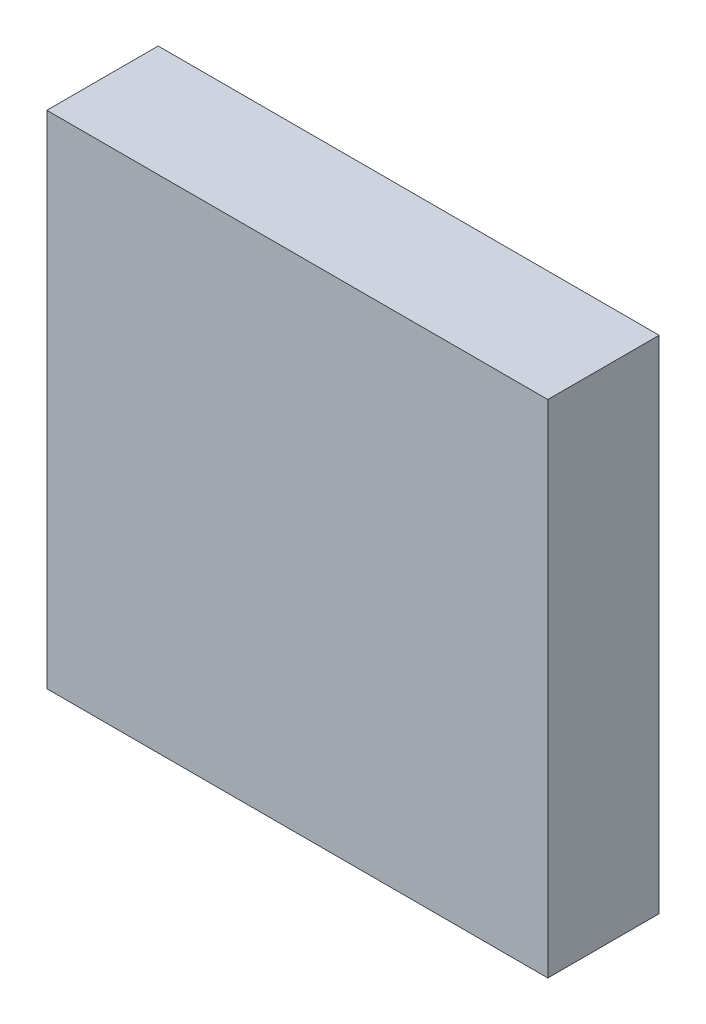
ISO-10303-21;
HEADER;
FILE_DESCRIPTION(('STEP AP214'),'2;1');
FILE_NAME('part.step','',(''),(''),'','','');
FILE_SCHEMA(('AUTOMOTIVE_DESIGN { 1 0 10303 214 1 1 1 1 }'));
ENDSEC;
DATA;
#1=APPLICATION_CONTEXT('core data for automotive mechanical design processes');
#2=APPLICATION_PROTOCOL_DEFINITION('international standard','automotive_design',2000,#1);
#3=PRODUCT_CONTEXT('',#1,'mechanical');
#4=PRODUCT('Part','Part','',(#3));
#5=PRODUCT_RELATED_PRODUCT_CATEGORY('part','',(#4));
#6=PRODUCT_DEFINITION_FORMATION('','',#4);
#7=PRODUCT_DEFINITION_CONTEXT('part definition',#1,'design');
#8=PRODUCT_DEFINITION('design','',#6,#7);
#9=PRODUCT_DEFINITION_SHAPE('','',#8);
#10=(LENGTH_UNIT() NAMED_UNIT(*) SI_UNIT(.MILLI.,.METRE.));
#11=(NAMED_UNIT(*) PLANE_ANGLE_UNIT() SI_UNIT($,.RADIAN.));
#12=(NAMED_UNIT(*) SI_UNIT($,.STERADIAN.) SOLID_ANGLE_UNIT());
#13=UNCERTAINTY_MEASURE_WITH_UNIT(LENGTH_MEASURE(1.E-05),#10,'distance_accuracy_value','');
#14=(GEOMETRIC_REPRESENTATION_CONTEXT(3) GLOBAL_UNCERTAINTY_ASSIGNED_CONTEXT((#13)) GLOBAL_UNIT_ASSIGNED_CONTEXT((#10,
#11,#12)) REPRESENTATION_CONTEXT('',''));
#15=CARTESIAN_POINT('',(0.,0.,0.));
#16=DIRECTION('',(0.,0.,1.));
#17=DIRECTION('',(1.,0.,0.));
#18=AXIS2_PLACEMENT_3D('',#15,#16,#17);
#19=CARTESIAN_POINT('',(-225.,-225.,100.));
#20=DIRECTION('',(1.,0.,0.));
#21=DIRECTION('',(0.,0.,-1.));
#22=AXIS2_PLACEMENT_3D('',#19,#20,#21);
#23=PLANE('',#22);
#24=DIRECTION('',(0.,-1.,0.));
#25=VECTOR('',#24,1.);
#26=CARTESIAN_POINT('',(-225.,-225.,0.));
#27=LINE('',#26,#25);
#28=CARTESIAN_POINT('',(-225.,225.,0.));
#29=VERTEX_POINT('',#28);
#30=CARTESIAN_POINT('',(-225.,-225.,0.));
#31=VERTEX_POINT('',#30);
#32=EDGE_CURVE('E99',#29,#31,#27,.T.);
#33=ORIENTED_EDGE('',*,*,#32,.T.);
#34=DIRECTION('',(0.,0.,-1.));
#35=VECTOR('',#34,1.);
#36=CARTESIAN_POINT('',(-225.,-225.,100.));
#37=LINE('',#36,#35);
#38=CARTESIAN_POINT('',(-225.,-225.,100.));
#39=VERTEX_POINT('',#38);
#40=EDGE_CURVE('E11',#39,#31,#37,.T.);
#41=ORIENTED_EDGE('',*,*,#40,.F.);
#42=DIRECTION('',(0.,-1.,0.));
#43=VECTOR('',#42,1.);
#44=CARTESIAN_POINT('',(-225.,-225.,100.));
#45=LINE('',#44,#43);
#46=CARTESIAN_POINT('',(-225.,225.,100.));
#47=VERTEX_POINT('',#46);
#48=EDGE_CURVE('E87',#47,#39,#45,.T.);
#49=ORIENTED_EDGE('',*,*,#48,.F.);
#50=DIRECTION('',(0.,0.,-1.));
#51=VECTOR('',#50,1.);
#52=CARTESIAN_POINT('',(-225.,225.,100.));
#53=LINE('',#52,#51);
#54=EDGE_CURVE('E95',#47,#29,#53,.T.);
#55=ORIENTED_EDGE('',*,*,#54,.T.);
#56=EDGE_LOOP('',(#33,#41,#49,#55));
#57=FACE_BOUND('',#56,.T.);
#58=ADVANCED_FACE('F36',(#57),#23,.F.);
#59=CARTESIAN_POINT('',(225.,-225.,100.));
#60=DIRECTION('',(0.,1.,0.));
#61=DIRECTION('',(-1.,0.,0.));
#62=AXIS2_PLACEMENT_3D('',#59,#60,#61);
#63=PLANE('',#62);
#64=DIRECTION('',(1.,0.,0.));
#65=VECTOR('',#64,1.);
#66=CARTESIAN_POINT('',(225.,-225.,0.));
#67=LINE('',#66,#65);
#68=CARTESIAN_POINT('',(225.,-225.,0.));
#69=VERTEX_POINT('',#68);
#70=EDGE_CURVE('E91',#31,#69,#67,.T.);
#71=ORIENTED_EDGE('',*,*,#70,.T.);
#72=DIRECTION('',(0.,0.,-1.));
#73=VECTOR('',#72,1.);
#74=CARTESIAN_POINT('',(225.,-225.,100.));
#75=LINE('',#74,#73);
#76=CARTESIAN_POINT('',(225.,-225.,100.));
#77=VERTEX_POINT('',#76);
#78=EDGE_CURVE('E44',#77,#69,#75,.T.);
#79=ORIENTED_EDGE('',*,*,#78,.F.);
#80=DIRECTION('',(1.,0.,0.));
#81=VECTOR('',#80,1.);
#82=CARTESIAN_POINT('',(225.,-225.,100.));
#83=LINE('',#82,#81);
#84=EDGE_CURVE('E82',#39,#77,#83,.T.);
#85=ORIENTED_EDGE('',*,*,#84,.F.);
#86=ORIENTED_EDGE('',*,*,#40,.T.);
#87=EDGE_LOOP('',(#71,#79,#85,#86));
#88=FACE_BOUND('',#87,.T.);
#89=ADVANCED_FACE('F90',(#88),#63,.F.);
#90=CARTESIAN_POINT('',(225.,-225.,100.));
#91=DIRECTION('',(-1.,0.,0.));
#92=DIRECTION('',(0.,0.,1.));
#93=AXIS2_PLACEMENT_3D('',#90,#91,#92);
#94=PLANE('',#93);
#95=DIRECTION('',(0.,1.,0.));
#96=VECTOR('',#95,1.);
#97=CARTESIAN_POINT('',(225.,-225.,0.));
#98=LINE('',#97,#96);
#99=CARTESIAN_POINT('',(225.,225.,0.));
#100=VERTEX_POINT('',#99);
#101=EDGE_CURVE('E69',#69,#100,#98,.T.);
#102=ORIENTED_EDGE('',*,*,#101,.T.);
#103=DIRECTION('',(0.,0.,-1.));
#104=VECTOR('',#103,1.);
#105=CARTESIAN_POINT('',(225.,225.,100.));
#106=LINE('',#105,#104);
#107=CARTESIAN_POINT('',(225.,225.,100.));
#108=VERTEX_POINT('',#107);
#109=EDGE_CURVE('E92',#108,#100,#106,.T.);
#110=ORIENTED_EDGE('',*,*,#109,.F.);
#111=DIRECTION('',(0.,1.,0.));
#112=VECTOR('',#111,1.);
#113=CARTESIAN_POINT('',(225.,-225.,100.));
#114=LINE('',#113,#112);
#115=EDGE_CURVE('E85',#77,#108,#114,.T.);
#116=ORIENTED_EDGE('',*,*,#115,.F.);
#117=ORIENTED_EDGE('',*,*,#78,.T.);
#118=EDGE_LOOP('',(#102,#110,#116,#117));
#119=FACE_BOUND('',#118,.T.);
#120=ADVANCED_FACE('F93',(#119),#94,.F.);
#121=CARTESIAN_POINT('',(225.,225.,100.));
#122=DIRECTION('',(0.,-1.,0.));
#123=DIRECTION('',(1.,0.,0.));
#124=AXIS2_PLACEMENT_3D('',#121,#122,#123);
#125=PLANE('',#124);
#126=DIRECTION('',(-1.,0.,0.));
#127=VECTOR('',#126,1.);
#128=CARTESIAN_POINT('',(225.,225.,0.));
#129=LINE('',#128,#127);
#130=EDGE_CURVE('E75',#100,#29,#129,.T.);
#131=ORIENTED_EDGE('',*,*,#130,.T.);
#132=ORIENTED_EDGE('',*,*,#54,.F.);
#133=DIRECTION('',(-1.,0.,0.));
#134=VECTOR('',#133,1.);
#135=CARTESIAN_POINT('',(225.,225.,100.));
#136=LINE('',#135,#134);
#137=EDGE_CURVE('E52',#108,#47,#136,.T.);
#138=ORIENTED_EDGE('',*,*,#137,.F.);
#139=ORIENTED_EDGE('',*,*,#109,.T.);
#140=EDGE_LOOP('',(#131,#132,#138,#139));
#141=FACE_BOUND('',#140,.T.);
#142=ADVANCED_FACE('F106',(#141),#125,.F.);
#143=CARTESIAN_POINT('',(0.,0.,100.));
#144=DIRECTION('',(0.,0.,1.));
#145=DIRECTION('',(1.,0.,0.));
#146=AXIS2_PLACEMENT_3D('',#143,#144,#145);
#147=PLANE('',#146);
#148=ORIENTED_EDGE('',*,*,#48,.T.);
#149=ORIENTED_EDGE('',*,*,#84,.T.);
#150=ORIENTED_EDGE('',*,*,#115,.T.);
#151=ORIENTED_EDGE('',*,*,#137,.T.);
#152=EDGE_LOOP('',(#148,#149,#150,#151));
#153=FACE_BOUND('',#152,.T.);
#154=ADVANCED_FACE('F83',(#153),#147,.T.);
#155=CARTESIAN_POINT('',(0.,0.,0.));
#156=DIRECTION('',(0.,0.,1.));
#157=DIRECTION('',(1.,0.,0.));
#158=AXIS2_PLACEMENT_3D('',#155,#156,#157);
#159=PLANE('',#158);
#160=ORIENTED_EDGE('',*,*,#32,.F.);
#161=ORIENTED_EDGE('',*,*,#130,.F.);
#162=ORIENTED_EDGE('',*,*,#101,.F.);
#163=ORIENTED_EDGE('',*,*,#70,.F.);
#164=EDGE_LOOP('',(#160,#161,#162,#163));
#165=FACE_BOUND('',#164,.T.);
#166=ADVANCED_FACE('F109',(#165),#159,.F.);
#167=CLOSED_SHELL('',(#58,#89,#120,#142,#154,#166));
#168=MANIFOLD_SOLID_BREP('B2',#167);
#169=ADVANCED_BREP_SHAPE_REPRESENTATION('',(#18,#168),#14);
#170=SHAPE_DEFINITION_REPRESENTATION(#9,#169);
ENDSEC;
END-ISO-10303-21;
